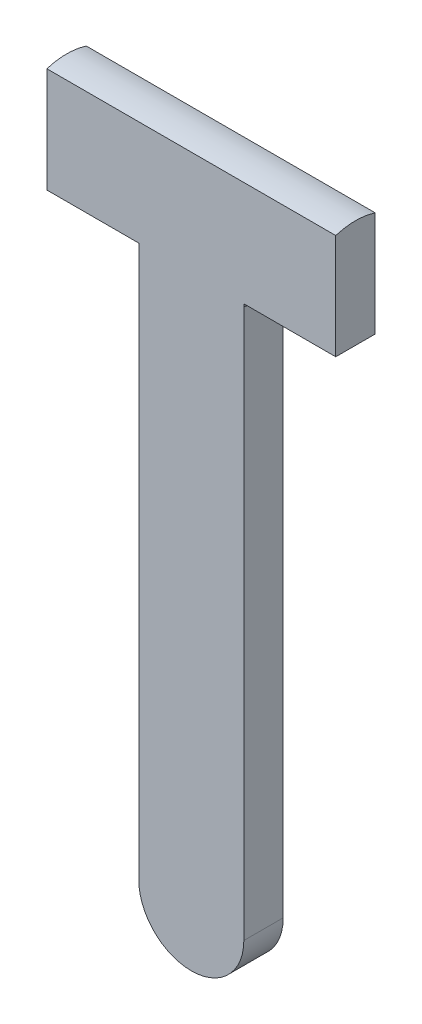
ISO-10303-21;
HEADER;
FILE_DESCRIPTION(('STEP AP214'),'2;1');
FILE_NAME('part.step','',(''),(''),'','','');
FILE_SCHEMA(('AUTOMOTIVE_DESIGN { 1 0 10303 214 1 1 1 1 }'));
ENDSEC;
DATA;
#1=APPLICATION_CONTEXT('core data for automotive mechanical design processes');
#2=APPLICATION_PROTOCOL_DEFINITION('international standard','automotive_design',2000,#1);
#3=PRODUCT_CONTEXT('',#1,'mechanical');
#4=PRODUCT('Part','Part','',(#3));
#5=PRODUCT_RELATED_PRODUCT_CATEGORY('part','',(#4));
#6=PRODUCT_DEFINITION_FORMATION('','',#4);
#7=PRODUCT_DEFINITION_CONTEXT('part definition',#1,'design');
#8=PRODUCT_DEFINITION('design','',#6,#7);
#9=PRODUCT_DEFINITION_SHAPE('','',#8);
#10=(LENGTH_UNIT() NAMED_UNIT(*) SI_UNIT(.MILLI.,.METRE.));
#11=(NAMED_UNIT(*) PLANE_ANGLE_UNIT() SI_UNIT($,.RADIAN.));
#12=(NAMED_UNIT(*) SI_UNIT($,.STERADIAN.) SOLID_ANGLE_UNIT());
#13=UNCERTAINTY_MEASURE_WITH_UNIT(LENGTH_MEASURE(1.E-05),#10,'distance_accuracy_value','');
#14=(GEOMETRIC_REPRESENTATION_CONTEXT(3) GLOBAL_UNCERTAINTY_ASSIGNED_CONTEXT((#13)) GLOBAL_UNIT_ASSIGNED_CONTEXT((#10,
#11,#12)) REPRESENTATION_CONTEXT('',''));
#15=CARTESIAN_POINT('',(0.,0.,0.));
#16=DIRECTION('',(0.,0.,1.));
#17=DIRECTION('',(1.,0.,0.));
#18=AXIS2_PLACEMENT_3D('',#15,#16,#17);
#19=CARTESIAN_POINT('',(2.,-4.,1.5));
#20=DIRECTION('',(0.,1.,0.));
#21=DIRECTION('',(0.,0.,1.));
#22=AXIS2_PLACEMENT_3D('',#19,#20,#21);
#23=PLANE('',#22);
#24=CARTESIAN_POINT('',(0.,-4.,0.75));
#25=DIRECTION('',(0.,-1.,0.));
#26=DIRECTION('',(0.,0.,-1.));
#27=AXIS2_PLACEMENT_3D('',#24,#25,#26);
#28=CIRCLE('',#27,2.13600093632938);
#29=CARTESIAN_POINT('',(2.,-4.,0.));
#30=VERTEX_POINT('',#29);
#31=CARTESIAN_POINT('',(2.,-4.,1.5));
#32=VERTEX_POINT('',#31);
#33=EDGE_CURVE('E143',#30,#32,#28,.T.);
#34=ORIENTED_EDGE('',*,*,#33,.F.);
#35=DIRECTION('',(1.,0.,0.));
#36=VECTOR('',#35,1.);
#37=CARTESIAN_POINT('',(2.,-4.,0.));
#38=LINE('',#37,#36);
#39=CARTESIAN_POINT('',(5.5,-4.,0.));
#40=VERTEX_POINT('',#39);
#41=EDGE_CURVE('E193',#30,#40,#38,.T.);
#42=ORIENTED_EDGE('',*,*,#41,.T.);
#43=DIRECTION('',(0.,0.,-1.));
#44=VECTOR('',#43,1.);
#45=CARTESIAN_POINT('',(5.5,-4.,1.5));
#46=LINE('',#45,#44);
#47=CARTESIAN_POINT('',(5.5,-4.,1.5));
#48=VERTEX_POINT('',#47);
#49=EDGE_CURVE('E182',#48,#40,#46,.T.);
#50=ORIENTED_EDGE('',*,*,#49,.F.);
#51=DIRECTION('',(1.,0.,0.));
#52=VECTOR('',#51,1.);
#53=CARTESIAN_POINT('',(2.,-4.,1.5));
#54=LINE('',#53,#52);
#55=EDGE_CURVE('E177',#32,#48,#54,.T.);
#56=ORIENTED_EDGE('',*,*,#55,.F.);
#57=EDGE_LOOP('',(#34,#42,#50,#56));
#58=FACE_BOUND('',#57,.T.);
#59=ADVANCED_FACE('F39',(#58),#23,.F.);
#60=CARTESIAN_POINT('',(-5.5,-4.,1.5));
#61=DIRECTION('',(0.,1.,0.));
#62=DIRECTION('',(0.,0.,1.));
#63=AXIS2_PLACEMENT_3D('',#60,#61,#62);
#64=PLANE('',#63);
#65=CARTESIAN_POINT('',(0.,-4.,0.75));
#66=DIRECTION('',(0.,-1.,0.));
#67=DIRECTION('',(0.,0.,-1.));
#68=AXIS2_PLACEMENT_3D('',#65,#66,#67);
#69=CIRCLE('',#68,2.13600093632938);
#70=CARTESIAN_POINT('',(-2.,-4.,1.5));
#71=VERTEX_POINT('',#70);
#72=CARTESIAN_POINT('',(-2.,-4.,0.));
#73=VERTEX_POINT('',#72);
#74=EDGE_CURVE('E155',#71,#73,#69,.T.);
#75=ORIENTED_EDGE('',*,*,#74,.F.);
#76=DIRECTION('',(1.,0.,0.));
#77=VECTOR('',#76,1.);
#78=CARTESIAN_POINT('',(-5.5,-4.,1.5));
#79=LINE('',#78,#77);
#80=CARTESIAN_POINT('',(-5.5,-4.,1.5));
#81=VERTEX_POINT('',#80);
#82=EDGE_CURVE('E166',#81,#71,#79,.T.);
#83=ORIENTED_EDGE('',*,*,#82,.F.);
#84=DIRECTION('',(0.,0.,-1.));
#85=VECTOR('',#84,1.);
#86=CARTESIAN_POINT('',(-5.5,-4.,1.5));
#87=LINE('',#86,#85);
#88=CARTESIAN_POINT('',(-5.5,-4.,0.));
#89=VERTEX_POINT('',#88);
#90=EDGE_CURVE('E12',#81,#89,#87,.T.);
#91=ORIENTED_EDGE('',*,*,#90,.T.);
#92=DIRECTION('',(1.,0.,0.));
#93=VECTOR('',#92,1.);
#94=CARTESIAN_POINT('',(-5.5,-4.,0.));
#95=LINE('',#94,#93);
#96=EDGE_CURVE('E124',#89,#73,#95,.T.);
#97=ORIENTED_EDGE('',*,*,#96,.T.);
#98=EDGE_LOOP('',(#75,#83,#91,#97));
#99=FACE_BOUND('',#98,.T.);
#100=ADVANCED_FACE('F227',(#99),#64,.F.);
#101=CARTESIAN_POINT('',(-5.5,0.,1.5));
#102=DIRECTION('',(1.,0.,0.));
#103=DIRECTION('',(0.,0.,-1.));
#104=AXIS2_PLACEMENT_3D('',#101,#102,#103);
#105=PLANE('',#104);
#106=DIRECTION('',(0.,-1.,0.));
#107=VECTOR('',#106,1.);
#108=CARTESIAN_POINT('',(-5.5,0.,0.));
#109=LINE('',#108,#107);
#110=CARTESIAN_POINT('',(-5.5,0.,0.));
#111=VERTEX_POINT('',#110);
#112=EDGE_CURVE('E117',#111,#89,#109,.T.);
#113=ORIENTED_EDGE('',*,*,#112,.T.);
#114=ORIENTED_EDGE('',*,*,#90,.F.);
#115=DIRECTION('',(0.,-1.,0.));
#116=VECTOR('',#115,1.);
#117=CARTESIAN_POINT('',(-5.5,0.,1.5));
#118=LINE('',#117,#116);
#119=CARTESIAN_POINT('',(-5.5,0.,1.5));
#120=VERTEX_POINT('',#119);
#121=EDGE_CURVE('E137',#120,#81,#118,.T.);
#122=ORIENTED_EDGE('',*,*,#121,.F.);
#123=CARTESIAN_POINT('',(-5.5,-2.38484800354236,0.75));
#124=DIRECTION('',(-1.,0.,0.));
#125=DIRECTION('',(0.,0.,1.));
#126=AXIS2_PLACEMENT_3D('',#123,#124,#125);
#127=CIRCLE('',#126,2.5);
#128=EDGE_CURVE('E134',#120,#111,#127,.T.);
#129=ORIENTED_EDGE('',*,*,#128,.T.);
#130=EDGE_LOOP('',(#113,#114,#122,#129));
#131=FACE_BOUND('',#130,.T.);
#132=ADVANCED_FACE('F41',(#131),#105,.F.);
#133=CARTESIAN_POINT('',(-2.,-4.,1.5));
#134=DIRECTION('',(1.,0.,0.));
#135=DIRECTION('',(0.,1.,0.));
#136=AXIS2_PLACEMENT_3D('',#133,#134,#135);
#137=PLANE('',#136);
#138=DIRECTION('',(0.,-1.,0.));
#139=VECTOR('',#138,1.);
#140=CARTESIAN_POINT('',(-2.,-4.,1.5));
#141=LINE('',#140,#139);
#142=CARTESIAN_POINT('',(-2.,-4.1,1.5));
#143=VERTEX_POINT('',#142);
#144=CARTESIAN_POINT('',(-2.,-25.,1.5));
#145=VERTEX_POINT('',#144);
#146=EDGE_CURVE('E169',#143,#145,#141,.T.);
#147=ORIENTED_EDGE('',*,*,#146,.F.);
#148=DIRECTION('',(0.,0.,1.));
#149=VECTOR('',#148,1.);
#150=CARTESIAN_POINT('',(-2.,-4.1,1.5));
#151=LINE('',#150,#149);
#152=CARTESIAN_POINT('',(-2.,-4.1,0.));
#153=VERTEX_POINT('',#152);
#154=EDGE_CURVE('E128',#153,#143,#151,.T.);
#155=ORIENTED_EDGE('',*,*,#154,.F.);
#156=DIRECTION('',(0.,-1.,0.));
#157=VECTOR('',#156,1.);
#158=CARTESIAN_POINT('',(-2.,-4.,0.));
#159=LINE('',#158,#157);
#160=CARTESIAN_POINT('',(-2.,-25.,0.));
#161=VERTEX_POINT('',#160);
#162=EDGE_CURVE('E185',#153,#161,#159,.T.);
#163=ORIENTED_EDGE('',*,*,#162,.T.);
#164=DIRECTION('',(0.,0.,-1.));
#165=VECTOR('',#164,1.);
#166=CARTESIAN_POINT('',(-2.,-25.,1.5));
#167=LINE('',#166,#165);
#168=EDGE_CURVE('E47',#145,#161,#167,.T.);
#169=ORIENTED_EDGE('',*,*,#168,.F.);
#170=EDGE_LOOP('',(#147,#155,#163,#169));
#171=FACE_BOUND('',#170,.T.);
#172=ADVANCED_FACE('F233',(#171),#137,.F.);
#173=CARTESIAN_POINT('',(0.,-25.,1.5));
#174=DIRECTION('',(0.,0.,-1.));
#175=DIRECTION('',(-1.,0.,0.));
#176=AXIS2_PLACEMENT_3D('',#173,#174,#175);
#177=CYLINDRICAL_SURFACE('',#176,2.);
#178=CARTESIAN_POINT('',(0.,-25.,0.));
#179=DIRECTION('',(0.,0.,1.));
#180=DIRECTION('',(1.,0.,0.));
#181=AXIS2_PLACEMENT_3D('',#178,#179,#180);
#182=CIRCLE('',#181,2.);
#183=CARTESIAN_POINT('',(2.,-25.,0.));
#184=VERTEX_POINT('',#183);
#185=EDGE_CURVE('E189',#161,#184,#182,.T.);
#186=ORIENTED_EDGE('',*,*,#185,.T.);
#187=DIRECTION('',(0.,0.,-1.));
#188=VECTOR('',#187,1.);
#189=CARTESIAN_POINT('',(2.,-25.,1.5));
#190=LINE('',#189,#188);
#191=CARTESIAN_POINT('',(2.,-25.,1.5));
#192=VERTEX_POINT('',#191);
#193=EDGE_CURVE('E198',#192,#184,#190,.T.);
#194=ORIENTED_EDGE('',*,*,#193,.F.);
#195=CARTESIAN_POINT('',(0.,-25.,1.5));
#196=DIRECTION('',(0.,0.,1.));
#197=DIRECTION('',(1.,0.,0.));
#198=AXIS2_PLACEMENT_3D('',#195,#196,#197);
#199=CIRCLE('',#198,2.);
#200=EDGE_CURVE('E173',#145,#192,#199,.T.);
#201=ORIENTED_EDGE('',*,*,#200,.F.);
#202=ORIENTED_EDGE('',*,*,#168,.T.);
#203=EDGE_LOOP('',(#186,#194,#201,#202));
#204=FACE_BOUND('',#203,.T.);
#205=ADVANCED_FACE('F205',(#204),#177,.T.);
#206=CARTESIAN_POINT('',(2.,-4.,1.5));
#207=DIRECTION('',(-1.,0.,0.));
#208=DIRECTION('',(0.,-1.,0.));
#209=AXIS2_PLACEMENT_3D('',#206,#207,#208);
#210=PLANE('',#209);
#211=DIRECTION('',(0.,1.,0.));
#212=VECTOR('',#211,1.);
#213=CARTESIAN_POINT('',(2.,-4.,0.));
#214=LINE('',#213,#212);
#215=CARTESIAN_POINT('',(2.,-4.1,0.));
#216=VERTEX_POINT('',#215);
#217=EDGE_CURVE('E191',#184,#216,#214,.T.);
#218=ORIENTED_EDGE('',*,*,#217,.T.);
#219=DIRECTION('',(0.,0.,-1.));
#220=VECTOR('',#219,1.);
#221=CARTESIAN_POINT('',(2.,-4.1,1.5));
#222=LINE('',#221,#220);
#223=CARTESIAN_POINT('',(2.,-4.1,1.5));
#224=VERTEX_POINT('',#223);
#225=EDGE_CURVE('E54',#224,#216,#222,.T.);
#226=ORIENTED_EDGE('',*,*,#225,.F.);
#227=DIRECTION('',(0.,1.,0.));
#228=VECTOR('',#227,1.);
#229=CARTESIAN_POINT('',(2.,-4.,1.5));
#230=LINE('',#229,#228);
#231=EDGE_CURVE('E175',#192,#224,#230,.T.);
#232=ORIENTED_EDGE('',*,*,#231,.F.);
#233=ORIENTED_EDGE('',*,*,#193,.T.);
#234=EDGE_LOOP('',(#218,#226,#232,#233));
#235=FACE_BOUND('',#234,.T.);
#236=ADVANCED_FACE('F209',(#235),#210,.F.);
#237=CARTESIAN_POINT('',(5.5,-4.,1.5));
#238=DIRECTION('',(-1.,0.,0.));
#239=DIRECTION('',(0.,-1.,0.));
#240=AXIS2_PLACEMENT_3D('',#237,#238,#239);
#241=PLANE('',#240);
#242=DIRECTION('',(0.,1.,0.));
#243=VECTOR('',#242,1.);
#244=CARTESIAN_POINT('',(5.5,-4.,0.));
#245=LINE('',#244,#243);
#246=CARTESIAN_POINT('',(5.5,0.,0.));
#247=VERTEX_POINT('',#246);
#248=EDGE_CURVE('E138',#40,#247,#245,.T.);
#249=ORIENTED_EDGE('',*,*,#248,.T.);
#250=CARTESIAN_POINT('',(5.5,-2.38484800354236,0.75));
#251=DIRECTION('',(-1.,0.,0.));
#252=DIRECTION('',(0.,-1.,0.));
#253=AXIS2_PLACEMENT_3D('',#250,#251,#252);
#254=CIRCLE('',#253,2.5);
#255=CARTESIAN_POINT('',(5.5,0.,1.5));
#256=VERTEX_POINT('',#255);
#257=EDGE_CURVE('E136',#247,#256,#254,.F.);
#258=ORIENTED_EDGE('',*,*,#257,.T.);
#259=DIRECTION('',(0.,1.,0.));
#260=VECTOR('',#259,1.);
#261=CARTESIAN_POINT('',(5.5,-4.,1.5));
#262=LINE('',#261,#260);
#263=EDGE_CURVE('E179',#48,#256,#262,.T.);
#264=ORIENTED_EDGE('',*,*,#263,.F.);
#265=ORIENTED_EDGE('',*,*,#49,.T.);
#266=EDGE_LOOP('',(#249,#258,#264,#265));
#267=FACE_BOUND('',#266,.T.);
#268=ADVANCED_FACE('F224',(#267),#241,.F.);
#269=CARTESIAN_POINT('',(0.,-25.,1.5));
#270=DIRECTION('',(0.,0.,1.));
#271=DIRECTION('',(1.,0.,0.));
#272=AXIS2_PLACEMENT_3D('',#269,#270,#271);
#273=PLANE('',#272);
#274=ORIENTED_EDGE('',*,*,#121,.T.);
#275=ORIENTED_EDGE('',*,*,#82,.T.);
#276=EDGE_CURVE('E170',#71,#143,#141,.T.);
#277=ORIENTED_EDGE('',*,*,#276,.T.);
#278=ORIENTED_EDGE('',*,*,#146,.T.);
#279=ORIENTED_EDGE('',*,*,#200,.T.);
#280=ORIENTED_EDGE('',*,*,#231,.T.);
#281=DIRECTION('',(0.,1.,0.));
#282=VECTOR('',#281,1.);
#283=CARTESIAN_POINT('',(2.,-4.1,1.5));
#284=LINE('',#283,#282);
#285=EDGE_CURVE('E153',#224,#32,#284,.T.);
#286=ORIENTED_EDGE('',*,*,#285,.T.);
#287=ORIENTED_EDGE('',*,*,#55,.T.);
#288=ORIENTED_EDGE('',*,*,#263,.T.);
#289=DIRECTION('',(-1.,0.,0.));
#290=VECTOR('',#289,1.);
#291=CARTESIAN_POINT('',(-5.5,0.,1.5));
#292=LINE('',#291,#290);
#293=EDGE_CURVE('E181',#256,#120,#292,.T.);
#294=ORIENTED_EDGE('',*,*,#293,.T.);
#295=EDGE_LOOP('',(#274,#275,#277,#278,#279,#280,#286,#287,#288,#294));
#296=FACE_BOUND('',#295,.T.);
#297=ADVANCED_FACE('F219',(#296),#273,.T.);
#298=CARTESIAN_POINT('',(0.,-25.,0.));
#299=DIRECTION('',(0.,0.,1.));
#300=DIRECTION('',(1.,0.,0.));
#301=AXIS2_PLACEMENT_3D('',#298,#299,#300);
#302=PLANE('',#301);
#303=ORIENTED_EDGE('',*,*,#112,.F.);
#304=DIRECTION('',(-1.,0.,0.));
#305=VECTOR('',#304,1.);
#306=CARTESIAN_POINT('',(-5.5,0.,0.));
#307=LINE('',#306,#305);
#308=EDGE_CURVE('E121',#247,#111,#307,.T.);
#309=ORIENTED_EDGE('',*,*,#308,.F.);
#310=ORIENTED_EDGE('',*,*,#248,.F.);
#311=ORIENTED_EDGE('',*,*,#41,.F.);
#312=DIRECTION('',(0.,1.,0.));
#313=VECTOR('',#312,1.);
#314=CARTESIAN_POINT('',(2.,-4.1,0.));
#315=LINE('',#314,#313);
#316=EDGE_CURVE('E62',#216,#30,#315,.T.);
#317=ORIENTED_EDGE('',*,*,#316,.F.);
#318=ORIENTED_EDGE('',*,*,#217,.F.);
#319=ORIENTED_EDGE('',*,*,#185,.F.);
#320=ORIENTED_EDGE('',*,*,#162,.F.);
#321=EDGE_CURVE('E186',#73,#153,#159,.T.);
#322=ORIENTED_EDGE('',*,*,#321,.F.);
#323=ORIENTED_EDGE('',*,*,#96,.F.);
#324=EDGE_LOOP('',(#303,#309,#310,#311,#317,#318,#319,#320,#322,#323));
#325=FACE_BOUND('',#324,.T.);
#326=ADVANCED_FACE('F119',(#325),#302,.F.);
#327=CARTESIAN_POINT('',(0.,-4.1,0.75));
#328=DIRECTION('',(0.,1.,0.));
#329=DIRECTION('',(0.,0.,1.));
#330=AXIS2_PLACEMENT_3D('',#327,#328,#329);
#331=CYLINDRICAL_SURFACE('',#330,2.13600093632938);
#332=ORIENTED_EDGE('',*,*,#74,.T.);
#333=ORIENTED_EDGE('',*,*,#321,.T.);
#334=CARTESIAN_POINT('',(0.,-4.1,0.75));
#335=DIRECTION('',(0.,-1.,0.));
#336=DIRECTION('',(0.,0.,-1.));
#337=AXIS2_PLACEMENT_3D('',#334,#335,#336);
#338=CIRCLE('',#337,2.13600093632938);
#339=EDGE_CURVE('E156',#143,#153,#338,.T.);
#340=ORIENTED_EDGE('',*,*,#339,.F.);
#341=ORIENTED_EDGE('',*,*,#276,.F.);
#342=EDGE_LOOP('',(#332,#333,#340,#341));
#343=FACE_BOUND('',#342,.T.);
#344=ADVANCED_FACE('F229',(#343),#331,.T.);
#345=CARTESIAN_POINT('',(0.,-4.1,0.75));
#346=DIRECTION('',(0.,-1.,0.));
#347=DIRECTION('',(0.,0.,-1.));
#348=AXIS2_PLACEMENT_3D('',#345,#346,#347);
#349=PLANE('',#348);
#350=ORIENTED_EDGE('',*,*,#339,.T.);
#351=ORIENTED_EDGE('',*,*,#154,.T.);
#352=EDGE_LOOP('',(#350,#351));
#353=FACE_BOUND('',#352,.T.);
#354=ADVANCED_FACE('F232',(#353),#349,.T.);
#355=CARTESIAN_POINT('',(0.,-4.1,0.75));
#356=DIRECTION('',(0.,1.,0.));
#357=DIRECTION('',(0.,0.,1.));
#358=AXIS2_PLACEMENT_3D('',#355,#356,#357);
#359=CYLINDRICAL_SURFACE('',#358,2.13600093632938);
#360=ORIENTED_EDGE('',*,*,#33,.T.);
#361=ORIENTED_EDGE('',*,*,#285,.F.);
#362=CARTESIAN_POINT('',(0.,-4.1,0.75));
#363=DIRECTION('',(0.,-1.,0.));
#364=DIRECTION('',(0.,0.,-1.));
#365=AXIS2_PLACEMENT_3D('',#362,#363,#364);
#366=CIRCLE('',#365,2.13600093632938);
#367=EDGE_CURVE('E146',#216,#224,#366,.T.);
#368=ORIENTED_EDGE('',*,*,#367,.F.);
#369=ORIENTED_EDGE('',*,*,#316,.T.);
#370=EDGE_LOOP('',(#360,#361,#368,#369));
#371=FACE_BOUND('',#370,.T.);
#372=ADVANCED_FACE('F215',(#371),#359,.T.);
#373=CARTESIAN_POINT('',(0.,-4.1,0.75));
#374=DIRECTION('',(0.,-1.,0.));
#375=DIRECTION('',(0.,0.,-1.));
#376=AXIS2_PLACEMENT_3D('',#373,#374,#375);
#377=PLANE('',#376);
#378=ORIENTED_EDGE('',*,*,#367,.T.);
#379=ORIENTED_EDGE('',*,*,#225,.T.);
#380=EDGE_LOOP('',(#378,#379));
#381=FACE_BOUND('',#380,.T.);
#382=ADVANCED_FACE('F212',(#381),#377,.T.);
#383=CARTESIAN_POINT('',(7.00441350109874,-2.38484800354236,0.75));
#384=DIRECTION('',(-1.,0.,0.));
#385=DIRECTION('',(0.,0.,1.));
#386=AXIS2_PLACEMENT_3D('',#383,#384,#385);
#387=CYLINDRICAL_SURFACE('',#386,2.5);
#388=ORIENTED_EDGE('',*,*,#257,.F.);
#389=ORIENTED_EDGE('',*,*,#308,.T.);
#390=ORIENTED_EDGE('',*,*,#128,.F.);
#391=ORIENTED_EDGE('',*,*,#293,.F.);
#392=EDGE_LOOP('',(#388,#389,#390,#391));
#393=FACE_BOUND('',#392,.T.);
#394=ADVANCED_FACE('F132',(#393),#387,.T.);
#395=CLOSED_SHELL('',(#59,#100,#132,#172,#205,#236,#268,#297,#326,#344,#354,#372,#382,#394));
#396=MANIFOLD_SOLID_BREP('B2',#395);
#397=ADVANCED_BREP_SHAPE_REPRESENTATION('',(#18,#396),#14);
#398=SHAPE_DEFINITION_REPRESENTATION(#9,#397);
ENDSEC;
END-ISO-10303-21;
